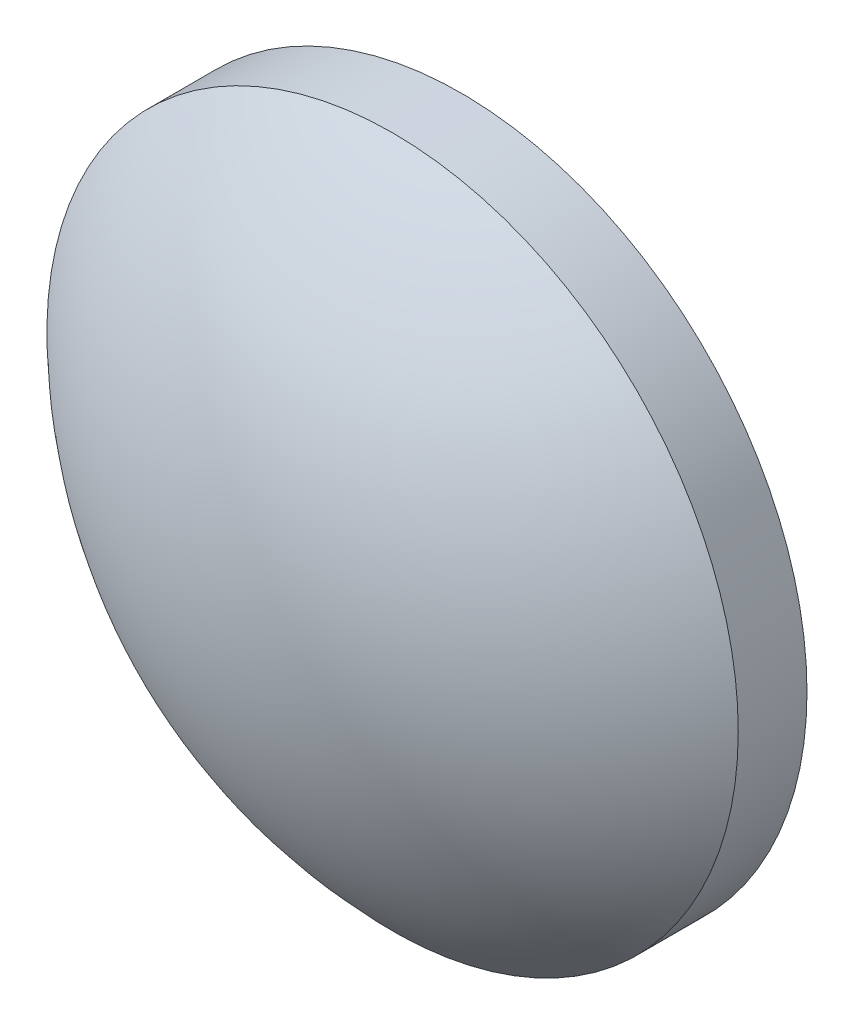
ISO-10303-21;
HEADER;
FILE_DESCRIPTION(('STEP AP214'),'2;1');
FILE_NAME('part.step','',(''),(''),'','','');
FILE_SCHEMA(('AUTOMOTIVE_DESIGN { 1 0 10303 214 1 1 1 1 }'));
ENDSEC;
DATA;
#1=APPLICATION_CONTEXT('core data for automotive mechanical design processes');
#2=APPLICATION_PROTOCOL_DEFINITION('international standard','automotive_design',2000,#1);
#3=PRODUCT_CONTEXT('',#1,'mechanical');
#4=PRODUCT('Part','Part','',(#3));
#5=PRODUCT_RELATED_PRODUCT_CATEGORY('part','',(#4));
#6=PRODUCT_DEFINITION_FORMATION('','',#4);
#7=PRODUCT_DEFINITION_CONTEXT('part definition',#1,'design');
#8=PRODUCT_DEFINITION('design','',#6,#7);
#9=PRODUCT_DEFINITION_SHAPE('','',#8);
#10=(LENGTH_UNIT() NAMED_UNIT(*) SI_UNIT(.MILLI.,.METRE.));
#11=(NAMED_UNIT(*) PLANE_ANGLE_UNIT() SI_UNIT($,.RADIAN.));
#12=(NAMED_UNIT(*) SI_UNIT($,.STERADIAN.) SOLID_ANGLE_UNIT());
#13=UNCERTAINTY_MEASURE_WITH_UNIT(LENGTH_MEASURE(1.E-05),#10,'distance_accuracy_value','');
#14=(GEOMETRIC_REPRESENTATION_CONTEXT(3) GLOBAL_UNCERTAINTY_ASSIGNED_CONTEXT((#13)) GLOBAL_UNIT_ASSIGNED_CONTEXT((#10,
#11,#12)) REPRESENTATION_CONTEXT('',''));
#15=CARTESIAN_POINT('',(0.,0.,0.));
#16=DIRECTION('',(0.,0.,1.));
#17=DIRECTION('',(1.,0.,0.));
#18=AXIS2_PLACEMENT_3D('',#15,#16,#17);
#19=CARTESIAN_POINT('',(0.,0.,-10.14));
#20=DIRECTION('',(0.,0.,1.));
#21=DIRECTION('',(0.,1.,0.));
#22=AXIS2_PLACEMENT_3D('',#19,#20,#21);
#23=SPHERICAL_SURFACE('',#22,12.87);
#24=CARTESIAN_POINT('',(0.,0.,-0.940168479803559));
#25=DIRECTION('',(0.,0.,1.));
#26=DIRECTION('',(1.,0.,0.));
#27=AXIS2_PLACEMENT_3D('',#24,#25,#26);
#28=CIRCLE('',#27,9.);
#29=CARTESIAN_POINT('',(9.,0.,-0.940168479803559));
#30=VERTEX_POINT('',#29);
#31=EDGE_CURVE('E8',#30,#30,#28,.T.);
#32=ORIENTED_EDGE('',*,*,#31,.T.);
#33=EDGE_LOOP('',(#32));
#34=FACE_BOUND('',#33,.T.);
#35=ADVANCED_FACE('F12',(#34),#23,.T.);
#36=CARTESIAN_POINT('',(0.,0.,4.30813204540037));
#37=DIRECTION('',(0.,0.,1.));
#38=DIRECTION('',(1.,0.,0.));
#39=AXIS2_PLACEMENT_3D('',#36,#37,#38);
#40=CYLINDRICAL_SURFACE('',#39,9.);
#41=ORIENTED_EDGE('',*,*,#31,.F.);
#42=EDGE_LOOP('',(#41));
#43=FACE_BOUND('',#42,.T.);
#44=CARTESIAN_POINT('',(0.,0.,-2.73));
#45=DIRECTION('',(0.,0.,1.));
#46=DIRECTION('',(1.,0.,0.));
#47=AXIS2_PLACEMENT_3D('',#44,#45,#46);
#48=CIRCLE('',#47,9.);
#49=CARTESIAN_POINT('',(9.,0.,-2.73));
#50=VERTEX_POINT('',#49);
#51=EDGE_CURVE('E18',#50,#50,#48,.T.);
#52=ORIENTED_EDGE('',*,*,#51,.T.);
#53=EDGE_LOOP('',(#52));
#54=FACE_BOUND('',#53,.T.);
#55=ADVANCED_FACE('F24',(#43,#54),#40,.T.);
#56=CARTESIAN_POINT('',(0.,0.,-2.73));
#57=DIRECTION('',(0.,0.,1.));
#58=DIRECTION('',(1.,0.,0.));
#59=AXIS2_PLACEMENT_3D('',#56,#57,#58);
#60=PLANE('',#59);
#61=ORIENTED_EDGE('',*,*,#51,.F.);
#62=EDGE_LOOP('',(#61));
#63=FACE_BOUND('',#62,.T.);
#64=ADVANCED_FACE('F26',(#63),#60,.F.);
#65=CLOSED_SHELL('',(#35,#55,#64));
#66=MANIFOLD_SOLID_BREP('B1',#65);
#67=ADVANCED_BREP_SHAPE_REPRESENTATION('',(#18,#66),#14);
#68=SHAPE_DEFINITION_REPRESENTATION(#9,#67);
ENDSEC;
END-ISO-10303-21;
